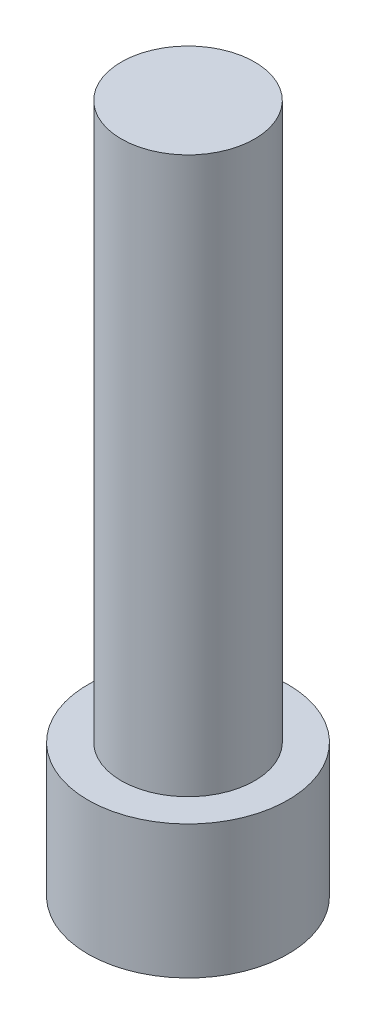
ISO-10303-21;
HEADER;
FILE_DESCRIPTION(('STEP AP214'),'2;1');
FILE_NAME('part.step','',(''),(''),'','','');
FILE_SCHEMA(('AUTOMOTIVE_DESIGN { 1 0 10303 214 1 1 1 1 }'));
ENDSEC;
DATA;
#1=APPLICATION_CONTEXT('core data for automotive mechanical design processes');
#2=APPLICATION_PROTOCOL_DEFINITION('international standard','automotive_design',2000,#1);
#3=PRODUCT_CONTEXT('',#1,'mechanical');
#4=PRODUCT('Part','Part','',(#3));
#5=PRODUCT_RELATED_PRODUCT_CATEGORY('part','',(#4));
#6=PRODUCT_DEFINITION_FORMATION('','',#4);
#7=PRODUCT_DEFINITION_CONTEXT('part definition',#1,'design');
#8=PRODUCT_DEFINITION('design','',#6,#7);
#9=PRODUCT_DEFINITION_SHAPE('','',#8);
#10=(LENGTH_UNIT() NAMED_UNIT(*) SI_UNIT(.MILLI.,.METRE.));
#11=(NAMED_UNIT(*) PLANE_ANGLE_UNIT() SI_UNIT($,.RADIAN.));
#12=(NAMED_UNIT(*) SI_UNIT($,.STERADIAN.) SOLID_ANGLE_UNIT());
#13=UNCERTAINTY_MEASURE_WITH_UNIT(LENGTH_MEASURE(1.E-05),#10,'distance_accuracy_value','');
#14=(GEOMETRIC_REPRESENTATION_CONTEXT(3) GLOBAL_UNCERTAINTY_ASSIGNED_CONTEXT((#13)) GLOBAL_UNIT_ASSIGNED_CONTEXT((#10,
#11,#12)) REPRESENTATION_CONTEXT('',''));
#15=CARTESIAN_POINT('',(0.,0.,0.));
#16=DIRECTION('',(0.,0.,1.));
#17=DIRECTION('',(1.,0.,0.));
#18=AXIS2_PLACEMENT_3D('',#15,#16,#17);
#19=CARTESIAN_POINT('',(0.,12.,0.));
#20=DIRECTION('',(0.,1.,0.));
#21=DIRECTION('',(0.,0.,1.));
#22=AXIS2_PLACEMENT_3D('',#19,#20,#21);
#23=PLANE('',#22);
#24=CARTESIAN_POINT('',(0.,12.,0.));
#25=DIRECTION('',(0.,1.,0.));
#26=DIRECTION('',(0.,0.,1.));
#27=AXIS2_PLACEMENT_3D('',#24,#25,#26);
#28=CIRCLE('',#27,9.);
#29=CARTESIAN_POINT('',(0.,12.,9.));
#30=VERTEX_POINT('',#29);
#31=EDGE_CURVE('E10',#30,#30,#28,.T.);
#32=ORIENTED_EDGE('',*,*,#31,.T.);
#33=EDGE_LOOP('',(#32));
#34=FACE_BOUND('',#33,.T.);
#35=CARTESIAN_POINT('',(0.,12.,0.));
#36=DIRECTION('',(0.,1.,0.));
#37=DIRECTION('',(0.,0.,1.));
#38=AXIS2_PLACEMENT_3D('',#35,#36,#37);
#39=CIRCLE('',#38,6.);
#40=CARTESIAN_POINT('',(0.,12.,6.));
#41=VERTEX_POINT('',#40);
#42=EDGE_CURVE('E42',#41,#41,#39,.T.);
#43=ORIENTED_EDGE('',*,*,#42,.F.);
#44=EDGE_LOOP('',(#43));
#45=FACE_BOUND('',#44,.T.);
#46=ADVANCED_FACE('F29',(#34,#45),#23,.T.);
#47=CARTESIAN_POINT('',(0.,12.,0.));
#48=DIRECTION('',(0.,-1.,0.));
#49=DIRECTION('',(0.,0.,-1.));
#50=AXIS2_PLACEMENT_3D('',#47,#48,#49);
#51=CYLINDRICAL_SURFACE('',#50,9.);
#52=ORIENTED_EDGE('',*,*,#31,.F.);
#53=EDGE_LOOP('',(#52));
#54=FACE_BOUND('',#53,.T.);
#55=CARTESIAN_POINT('',(0.,0.,0.));
#56=DIRECTION('',(0.,1.,0.));
#57=DIRECTION('',(0.,0.,1.));
#58=AXIS2_PLACEMENT_3D('',#55,#56,#57);
#59=CIRCLE('',#58,9.);
#60=CARTESIAN_POINT('',(0.,0.,9.));
#61=VERTEX_POINT('',#60);
#62=EDGE_CURVE('E33',#61,#61,#59,.T.);
#63=ORIENTED_EDGE('',*,*,#62,.T.);
#64=EDGE_LOOP('',(#63));
#65=FACE_BOUND('',#64,.T.);
#66=ADVANCED_FACE('F31',(#54,#65),#51,.T.);
#67=CARTESIAN_POINT('',(0.,0.,0.));
#68=DIRECTION('',(0.,1.,0.));
#69=DIRECTION('',(0.,0.,1.));
#70=AXIS2_PLACEMENT_3D('',#67,#68,#69);
#71=PLANE('',#70);
#72=ORIENTED_EDGE('',*,*,#62,.F.);
#73=EDGE_LOOP('',(#72));
#74=FACE_BOUND('',#73,.T.);
#75=ADVANCED_FACE('F53',(#74),#71,.F.);
#76=CARTESIAN_POINT('',(0.,62.,0.));
#77=DIRECTION('',(0.,-1.,0.));
#78=DIRECTION('',(0.,0.,-1.));
#79=AXIS2_PLACEMENT_3D('',#76,#77,#78);
#80=CYLINDRICAL_SURFACE('',#79,6.);
#81=CARTESIAN_POINT('',(0.,62.,0.));
#82=DIRECTION('',(0.,1.,0.));
#83=DIRECTION('',(0.,0.,1.));
#84=AXIS2_PLACEMENT_3D('',#81,#82,#83);
#85=CIRCLE('',#84,6.);
#86=CARTESIAN_POINT('',(0.,62.,6.));
#87=VERTEX_POINT('',#86);
#88=EDGE_CURVE('E40',#87,#87,#85,.T.);
#89=ORIENTED_EDGE('',*,*,#88,.F.);
#90=EDGE_LOOP('',(#89));
#91=FACE_BOUND('',#90,.T.);
#92=ORIENTED_EDGE('',*,*,#42,.T.);
#93=EDGE_LOOP('',(#92));
#94=FACE_BOUND('',#93,.T.);
#95=ADVANCED_FACE('F50',(#91,#94),#80,.T.);
#96=CARTESIAN_POINT('',(0.,62.,0.));
#97=DIRECTION('',(0.,1.,0.));
#98=DIRECTION('',(0.,0.,1.));
#99=AXIS2_PLACEMENT_3D('',#96,#97,#98);
#100=PLANE('',#99);
#101=ORIENTED_EDGE('',*,*,#88,.T.);
#102=EDGE_LOOP('',(#101));
#103=FACE_BOUND('',#102,.T.);
#104=ADVANCED_FACE('F48',(#103),#100,.T.);
#105=CLOSED_SHELL('',(#46,#66,#75,#95,#104));
#106=MANIFOLD_SOLID_BREP('B2',#105);
#107=ADVANCED_BREP_SHAPE_REPRESENTATION('',(#18,#106),#14);
#108=SHAPE_DEFINITION_REPRESENTATION(#9,#107);
ENDSEC;
END-ISO-10303-21;
